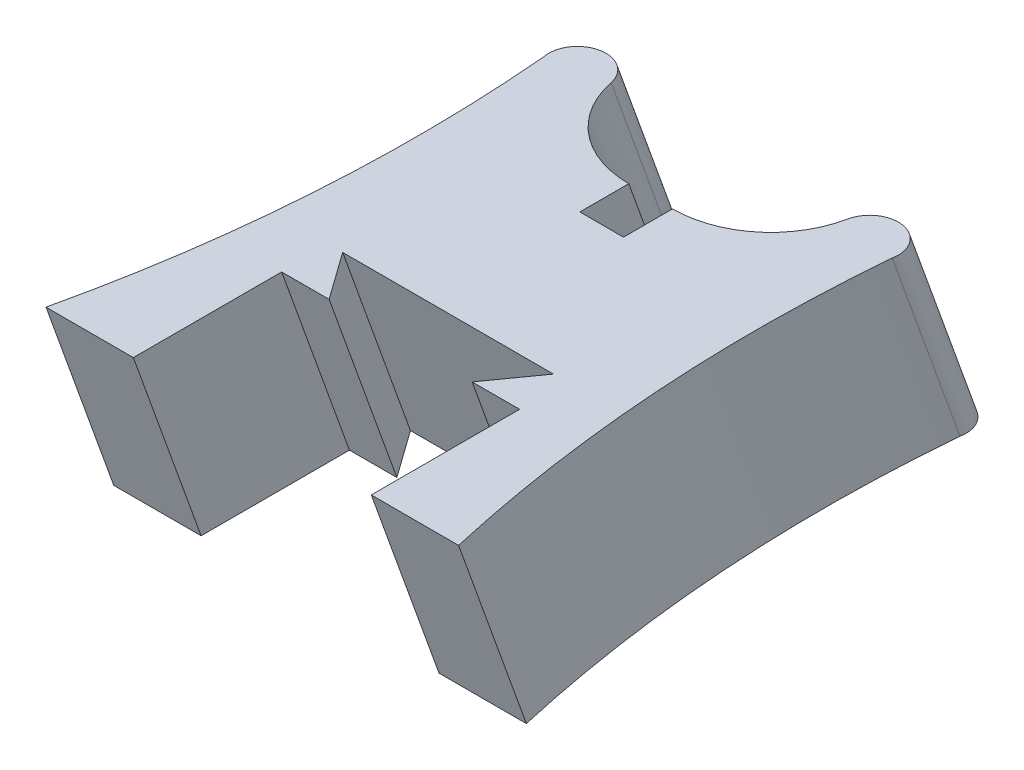
ISO-10303-21;
HEADER;
FILE_DESCRIPTION(('STEP AP214'),'2;1');
FILE_NAME('part.step','',(''),(''),'','','');
FILE_SCHEMA(('AUTOMOTIVE_DESIGN { 1 0 10303 214 1 1 1 1 }'));
ENDSEC;
DATA;
#1=APPLICATION_CONTEXT('core data for automotive mechanical design processes');
#2=APPLICATION_PROTOCOL_DEFINITION('international standard','automotive_design',2000,#1);
#3=PRODUCT_CONTEXT('',#1,'mechanical');
#4=PRODUCT('Part','Part','',(#3));
#5=PRODUCT_RELATED_PRODUCT_CATEGORY('part','',(#4));
#6=PRODUCT_DEFINITION_FORMATION('','',#4);
#7=PRODUCT_DEFINITION_CONTEXT('part definition',#1,'design');
#8=PRODUCT_DEFINITION('design','',#6,#7);
#9=PRODUCT_DEFINITION_SHAPE('','',#8);
#10=(LENGTH_UNIT() NAMED_UNIT(*) SI_UNIT(.MILLI.,.METRE.));
#11=(NAMED_UNIT(*) PLANE_ANGLE_UNIT() SI_UNIT($,.RADIAN.));
#12=(NAMED_UNIT(*) SI_UNIT($,.STERADIAN.) SOLID_ANGLE_UNIT());
#13=UNCERTAINTY_MEASURE_WITH_UNIT(LENGTH_MEASURE(1.E-05),#10,'distance_accuracy_value','');
#14=(GEOMETRIC_REPRESENTATION_CONTEXT(3) GLOBAL_UNCERTAINTY_ASSIGNED_CONTEXT((#13)) GLOBAL_UNIT_ASSIGNED_CONTEXT((#10,
#11,#12)) REPRESENTATION_CONTEXT('',''));
#15=CARTESIAN_POINT('',(0.,0.,0.));
#16=DIRECTION('',(0.,0.,1.));
#17=DIRECTION('',(1.,0.,0.));
#18=AXIS2_PLACEMENT_3D('',#15,#16,#17);
#19=CARTESIAN_POINT('',(56.4865108892808,6.35,1.36219321103716));
#20=DIRECTION('',(0.,-1.,0.));
#21=DIRECTION('',(0.,0.,1.));
#22=AXIS2_PLACEMENT_3D('',#19,#20,#21);
#23=CIRCLE('',#22,50.8);
#24=DIRECTION('',(0.,-0.940887411868727,-0.338719468272742));
#25=VECTOR('',#24,1.);
#26=SURFACE_OF_LINEAR_EXTRUSION('',#23,#25);
#27=CARTESIAN_POINT('',(56.4865108892808,0.,-0.923806788962845));
#28=DIRECTION('',(0.,-1.,0.));
#29=DIRECTION('',(0.,0.,1.));
#30=AXIS2_PLACEMENT_3D('',#27,#28,#29);
#31=CIRCLE('',#30,50.8);
#32=CARTESIAN_POINT('',(6.9596,0.,10.3777461027968));
#33=VERTEX_POINT('',#32);
#34=CARTESIAN_POINT('',(5.87772964845162,0.,-5.32735777855067));
#35=VERTEX_POINT('',#34);
#36=EDGE_CURVE('E189',#33,#35,#31,.T.);
#37=ORIENTED_EDGE('',*,*,#36,.T.);
#38=DIRECTION('',(0.,-0.940887411868727,-0.338719468272742));
#39=VECTOR('',#38,1.);
#40=CARTESIAN_POINT('',(5.87772964845162,6.35,-3.04135777855067));
#41=LINE('',#40,#39);
#42=CARTESIAN_POINT('',(5.87772964845162,6.35,-3.04135777855067));
#43=VERTEX_POINT('',#42);
#44=EDGE_CURVE('E11',#43,#35,#41,.T.);
#45=ORIENTED_EDGE('',*,*,#44,.F.);
#46=CARTESIAN_POINT('',(6.9596,6.35,12.6637461027968));
#47=VERTEX_POINT('',#46);
#48=EDGE_CURVE('E223',#47,#43,#23,.T.);
#49=ORIENTED_EDGE('',*,*,#48,.F.);
#50=DIRECTION('',(0.,-0.940887411868727,-0.338719468272742));
#51=VECTOR('',#50,1.);
#52=CARTESIAN_POINT('',(6.9596,6.35,12.6637461027968));
#53=LINE('',#52,#51);
#54=EDGE_CURVE('E185',#47,#33,#53,.T.);
#55=ORIENTED_EDGE('',*,*,#54,.T.);
#56=EDGE_LOOP('',(#37,#45,#49,#55));
#57=FACE_BOUND('',#56,.T.);
#58=ADVANCED_FACE('F32',(#57),#26,.F.);
#59=CARTESIAN_POINT('',(4.93229971902358,6.35,-3.23420816170402));
#60=DIRECTION('',(0.,1.,0.));
#61=DIRECTION('',(0.,0.,-1.));
#62=AXIS2_PLACEMENT_3D('',#59,#60,#61);
#63=CIRCLE('',#62,0.964898451517419);
#64=DIRECTION('',(0.,-0.940887411868727,-0.338719468272742));
#65=VECTOR('',#64,1.);
#66=SURFACE_OF_LINEAR_EXTRUSION('',#63,#65);
#67=CARTESIAN_POINT('',(4.93229971902358,0.,-5.52020816170402));
#68=DIRECTION('',(0.,1.,0.));
#69=DIRECTION('',(0.,0.,-1.));
#70=AXIS2_PLACEMENT_3D('',#67,#68,#69);
#71=CIRCLE('',#70,0.964898451517419);
#72=CARTESIAN_POINT('',(3.98686978959553,0.,-5.71305854485738));
#73=VERTEX_POINT('',#72);
#74=EDGE_CURVE('E192',#35,#73,#71,.T.);
#75=ORIENTED_EDGE('',*,*,#74,.T.);
#76=DIRECTION('',(0.,-0.940887411868727,-0.338719468272742));
#77=VECTOR('',#76,1.);
#78=CARTESIAN_POINT('',(3.98686978959553,6.35,-3.42705854485738));
#79=LINE('',#78,#77);
#80=CARTESIAN_POINT('',(3.98686978959553,6.35,-3.42705854485738));
#81=VERTEX_POINT('',#80);
#82=EDGE_CURVE('E41',#81,#73,#79,.T.);
#83=ORIENTED_EDGE('',*,*,#82,.F.);
#84=EDGE_CURVE('E122',#43,#81,#63,.T.);
#85=ORIENTED_EDGE('',*,*,#84,.F.);
#86=ORIENTED_EDGE('',*,*,#44,.T.);
#87=EDGE_LOOP('',(#75,#83,#85,#86));
#88=FACE_BOUND('',#87,.T.);
#89=ADVANCED_FACE('F315',(#88),#66,.F.);
#90=CARTESIAN_POINT('',(0.7366,6.35,-4.09005402951957));
#91=DIRECTION('',(0.,-1.,0.));
#92=DIRECTION('',(0.,0.,1.));
#93=AXIS2_PLACEMENT_3D('',#90,#91,#92);
#94=CIRCLE('',#93,3.31720013231639);
#95=DIRECTION('',(0.,-0.940887411868727,-0.338719468272742));
#96=VECTOR('',#95,1.);
#97=SURFACE_OF_LINEAR_EXTRUSION('',#94,#96);
#98=CARTESIAN_POINT('',(0.7366,0.,-6.37605402951957));
#99=DIRECTION('',(0.,-1.,0.));
#100=DIRECTION('',(0.,0.,1.));
#101=AXIS2_PLACEMENT_3D('',#98,#99,#100);
#102=CIRCLE('',#101,3.31720013231639);
#103=CARTESIAN_POINT('',(0.7366,0.,-3.05885389720318));
#104=VERTEX_POINT('',#103);
#105=EDGE_CURVE('E194',#73,#104,#102,.T.);
#106=ORIENTED_EDGE('',*,*,#105,.T.);
#107=DIRECTION('',(0.,-0.940887411868727,-0.338719468272742));
#108=VECTOR('',#107,1.);
#109=CARTESIAN_POINT('',(0.7366,6.35,-0.772853897203182));
#110=LINE('',#109,#108);
#111=CARTESIAN_POINT('',(0.7366,6.35,-0.772853897203182));
#112=VERTEX_POINT('',#111);
#113=EDGE_CURVE('E260',#112,#104,#110,.T.);
#114=ORIENTED_EDGE('',*,*,#113,.F.);
#115=EDGE_CURVE('E268',#81,#112,#94,.T.);
#116=ORIENTED_EDGE('',*,*,#115,.F.);
#117=ORIENTED_EDGE('',*,*,#82,.T.);
#118=EDGE_LOOP('',(#106,#114,#116,#117));
#119=FACE_BOUND('',#118,.T.);
#120=ADVANCED_FACE('F266',(#119),#97,.F.);
#121=CARTESIAN_POINT('',(0.7366,6.35,0.878146102796818));
#122=DIRECTION('',(1.,0.,0.));
#123=DIRECTION('',(0.,0.,-1.));
#124=AXIS2_PLACEMENT_3D('',#121,#122,#123);
#125=PLANE('',#124);
#126=DIRECTION('',(0.,0.,1.));
#127=VECTOR('',#126,1.);
#128=CARTESIAN_POINT('',(0.7366,0.,-1.40785389720318));
#129=LINE('',#128,#127);
#130=CARTESIAN_POINT('',(0.7366,0.,-1.40785389720318));
#131=VERTEX_POINT('',#130);
#132=EDGE_CURVE('E196',#104,#131,#129,.T.);
#133=ORIENTED_EDGE('',*,*,#132,.T.);
#134=DIRECTION('',(0.,-0.940887411868727,-0.338719468272742));
#135=VECTOR('',#134,1.);
#136=CARTESIAN_POINT('',(0.7366,6.35,0.878146102796818));
#137=LINE('',#136,#135);
#138=CARTESIAN_POINT('',(0.7366,6.35,0.878146102796818));
#139=VERTEX_POINT('',#138);
#140=EDGE_CURVE('E257',#139,#131,#137,.T.);
#141=ORIENTED_EDGE('',*,*,#140,.F.);
#142=DIRECTION('',(0.,0.,1.));
#143=VECTOR('',#142,1.);
#144=CARTESIAN_POINT('',(0.7366,6.35,0.878146102796818));
#145=LINE('',#144,#143);
#146=EDGE_CURVE('E286',#112,#139,#145,.T.);
#147=ORIENTED_EDGE('',*,*,#146,.F.);
#148=ORIENTED_EDGE('',*,*,#113,.T.);
#149=EDGE_LOOP('',(#133,#141,#147,#148));
#150=FACE_BOUND('',#149,.T.);
#151=ADVANCED_FACE('F277',(#150),#125,.F.);
#152=CARTESIAN_POINT('',(-0.7366,6.35,0.878146102796818));
#153=DIRECTION('',(0.,-0.338719468272742,0.940887411868727));
#154=DIRECTION('',(0.,-0.940887411868727,-0.338719468272742));
#155=AXIS2_PLACEMENT_3D('',#152,#153,#154);
#156=PLANE('',#155);
#157=DIRECTION('',(-1.,0.,0.));
#158=VECTOR('',#157,1.);
#159=CARTESIAN_POINT('',(-0.7366,0.,-1.40785389720318));
#160=LINE('',#159,#158);
#161=CARTESIAN_POINT('',(-0.7366,0.,-1.40785389720318));
#162=VERTEX_POINT('',#161);
#163=EDGE_CURVE('E198',#131,#162,#160,.T.);
#164=ORIENTED_EDGE('',*,*,#163,.T.);
#165=DIRECTION('',(0.,-0.940887411868727,-0.338719468272742));
#166=VECTOR('',#165,1.);
#167=CARTESIAN_POINT('',(-0.7366,6.35,0.878146102796818));
#168=LINE('',#167,#166);
#169=CARTESIAN_POINT('',(-0.7366,6.35,0.878146102796818));
#170=VERTEX_POINT('',#169);
#171=EDGE_CURVE('E254',#170,#162,#168,.T.);
#172=ORIENTED_EDGE('',*,*,#171,.F.);
#173=DIRECTION('',(-1.,0.,0.));
#174=VECTOR('',#173,1.);
#175=CARTESIAN_POINT('',(-0.7366,6.35,0.878146102796818));
#176=LINE('',#175,#174);
#177=EDGE_CURVE('E283',#139,#170,#176,.T.);
#178=ORIENTED_EDGE('',*,*,#177,.F.);
#179=ORIENTED_EDGE('',*,*,#140,.T.);
#180=EDGE_LOOP('',(#164,#172,#178,#179));
#181=FACE_BOUND('',#180,.T.);
#182=ADVANCED_FACE('F281',(#181),#156,.F.);
#183=CARTESIAN_POINT('',(-0.7366,6.35,-0.772853897203182));
#184=DIRECTION('',(-1.,0.,0.));
#185=DIRECTION('',(0.,0.,1.));
#186=AXIS2_PLACEMENT_3D('',#183,#184,#185);
#187=PLANE('',#186);
#188=DIRECTION('',(0.,0.,-1.));
#189=VECTOR('',#188,1.);
#190=CARTESIAN_POINT('',(-0.7366,0.,-3.05885389720318));
#191=LINE('',#190,#189);
#192=CARTESIAN_POINT('',(-0.7366,0.,-3.05885389720318));
#193=VERTEX_POINT('',#192);
#194=EDGE_CURVE('E200',#162,#193,#191,.T.);
#195=ORIENTED_EDGE('',*,*,#194,.T.);
#196=DIRECTION('',(0.,-0.940887411868727,-0.338719468272742));
#197=VECTOR('',#196,1.);
#198=CARTESIAN_POINT('',(-0.7366,6.35,-0.772853897203181));
#199=LINE('',#198,#197);
#200=CARTESIAN_POINT('',(-0.7366,6.35,-0.772853897203181));
#201=VERTEX_POINT('',#200);
#202=EDGE_CURVE('E251',#201,#193,#199,.T.);
#203=ORIENTED_EDGE('',*,*,#202,.F.);
#204=DIRECTION('',(0.,0.,-1.));
#205=VECTOR('',#204,1.);
#206=CARTESIAN_POINT('',(-0.7366,6.35,-0.772853897203182));
#207=LINE('',#206,#205);
#208=EDGE_CURVE('E285',#170,#201,#207,.T.);
#209=ORIENTED_EDGE('',*,*,#208,.F.);
#210=ORIENTED_EDGE('',*,*,#171,.T.);
#211=EDGE_LOOP('',(#195,#203,#209,#210));
#212=FACE_BOUND('',#211,.T.);
#213=ADVANCED_FACE('F304',(#212),#187,.F.);
#214=CARTESIAN_POINT('',(-0.7366,6.35,-4.09005402951957));
#215=DIRECTION('',(0.,-1.,0.));
#216=DIRECTION('',(0.,0.,-1.));
#217=AXIS2_PLACEMENT_3D('',#214,#215,#216);
#218=CIRCLE('',#217,3.31720013231639);
#219=DIRECTION('',(0.,-0.940887411868727,-0.338719468272742));
#220=VECTOR('',#219,1.);
#221=SURFACE_OF_LINEAR_EXTRUSION('',#218,#220);
#222=CARTESIAN_POINT('',(-0.7366,0.,-6.37605402951957));
#223=DIRECTION('',(0.,-1.,0.));
#224=DIRECTION('',(0.,0.,-1.));
#225=AXIS2_PLACEMENT_3D('',#222,#223,#224);
#226=CIRCLE('',#225,3.31720013231639);
#227=CARTESIAN_POINT('',(-3.98686978959554,0.,-5.71305854485738));
#228=VERTEX_POINT('',#227);
#229=EDGE_CURVE('E202',#193,#228,#226,.T.);
#230=ORIENTED_EDGE('',*,*,#229,.T.);
#231=DIRECTION('',(0.,-0.940887411868727,-0.338719468272742));
#232=VECTOR('',#231,1.);
#233=CARTESIAN_POINT('',(-3.98686978959554,6.35,-3.42705854485738));
#234=LINE('',#233,#232);
#235=CARTESIAN_POINT('',(-3.98686978959554,6.35,-3.42705854485738));
#236=VERTEX_POINT('',#235);
#237=EDGE_CURVE('E248',#236,#228,#234,.T.);
#238=ORIENTED_EDGE('',*,*,#237,.F.);
#239=EDGE_CURVE('E288',#201,#236,#218,.T.);
#240=ORIENTED_EDGE('',*,*,#239,.F.);
#241=ORIENTED_EDGE('',*,*,#202,.T.);
#242=EDGE_LOOP('',(#230,#238,#240,#241));
#243=FACE_BOUND('',#242,.T.);
#244=ADVANCED_FACE('F299',(#243),#221,.F.);
#245=CARTESIAN_POINT('',(-4.93229971902358,6.35,-3.23420816170402));
#246=DIRECTION('',(0.,1.,0.));
#247=DIRECTION('',(0.,0.,1.));
#248=AXIS2_PLACEMENT_3D('',#245,#246,#247);
#249=CIRCLE('',#248,0.964898451517418);
#250=DIRECTION('',(0.,-0.940887411868727,-0.338719468272742));
#251=VECTOR('',#250,1.);
#252=SURFACE_OF_LINEAR_EXTRUSION('',#249,#251);
#253=CARTESIAN_POINT('',(-4.93229971902358,0.,-5.52020816170402));
#254=DIRECTION('',(0.,1.,0.));
#255=DIRECTION('',(0.,0.,1.));
#256=AXIS2_PLACEMENT_3D('',#253,#254,#255);
#257=CIRCLE('',#256,0.964898451517418);
#258=CARTESIAN_POINT('',(-5.87772964845162,0.,-5.32735777855066));
#259=VERTEX_POINT('',#258);
#260=EDGE_CURVE('E204',#228,#259,#257,.T.);
#261=ORIENTED_EDGE('',*,*,#260,.T.);
#262=DIRECTION('',(0.,-0.940887411868727,-0.338719468272742));
#263=VECTOR('',#262,1.);
#264=CARTESIAN_POINT('',(-5.87772964845162,6.35,-3.04135777855066));
#265=LINE('',#264,#263);
#266=CARTESIAN_POINT('',(-5.87772964845162,6.35,-3.04135777855066));
#267=VERTEX_POINT('',#266);
#268=EDGE_CURVE('E245',#267,#259,#265,.T.);
#269=ORIENTED_EDGE('',*,*,#268,.F.);
#270=EDGE_CURVE('E295',#236,#267,#249,.T.);
#271=ORIENTED_EDGE('',*,*,#270,.F.);
#272=ORIENTED_EDGE('',*,*,#237,.T.);
#273=EDGE_LOOP('',(#261,#269,#271,#272));
#274=FACE_BOUND('',#273,.T.);
#275=ADVANCED_FACE('F303',(#274),#252,.F.);
#276=CARTESIAN_POINT('',(-56.4865108892808,6.35,1.36219321103716));
#277=DIRECTION('',(0.,-1.,0.));
#278=DIRECTION('',(0.,0.,-1.));
#279=AXIS2_PLACEMENT_3D('',#276,#277,#278);
#280=CIRCLE('',#279,50.8);
#281=DIRECTION('',(0.,-0.940887411868727,-0.338719468272742));
#282=VECTOR('',#281,1.);
#283=SURFACE_OF_LINEAR_EXTRUSION('',#280,#282);
#284=CARTESIAN_POINT('',(-56.4865108892808,0.,-0.923806788962845));
#285=DIRECTION('',(0.,-1.,0.));
#286=DIRECTION('',(0.,0.,-1.));
#287=AXIS2_PLACEMENT_3D('',#284,#285,#286);
#288=CIRCLE('',#287,50.8);
#289=CARTESIAN_POINT('',(-6.9596,0.,10.3777461027968));
#290=VERTEX_POINT('',#289);
#291=EDGE_CURVE('E206',#259,#290,#288,.T.);
#292=ORIENTED_EDGE('',*,*,#291,.T.);
#293=DIRECTION('',(0.,-0.940887411868727,-0.338719468272742));
#294=VECTOR('',#293,1.);
#295=CARTESIAN_POINT('',(-6.9596,6.35,12.6637461027968));
#296=LINE('',#295,#294);
#297=CARTESIAN_POINT('',(-6.9596,6.35,12.6637461027968));
#298=VERTEX_POINT('',#297);
#299=EDGE_CURVE('E242',#298,#290,#296,.T.);
#300=ORIENTED_EDGE('',*,*,#299,.F.);
#301=EDGE_CURVE('E485',#267,#298,#280,.T.);
#302=ORIENTED_EDGE('',*,*,#301,.F.);
#303=ORIENTED_EDGE('',*,*,#268,.T.);
#304=EDGE_LOOP('',(#292,#300,#302,#303));
#305=FACE_BOUND('',#304,.T.);
#306=ADVANCED_FACE('F372',(#305),#283,.F.);
#307=CARTESIAN_POINT('',(-4.0132,6.35,12.6637461027968));
#308=DIRECTION('',(0.,0.338719468272742,-0.940887411868727));
#309=DIRECTION('',(0.,0.940887411868727,0.338719468272742));
#310=AXIS2_PLACEMENT_3D('',#307,#308,#309);
#311=PLANE('',#310);
#312=DIRECTION('',(1.,0.,0.));
#313=VECTOR('',#312,1.);
#314=CARTESIAN_POINT('',(-4.0132,0.,10.3777461027968));
#315=LINE('',#314,#313);
#316=CARTESIAN_POINT('',(-4.0132,0.,10.3777461027968));
#317=VERTEX_POINT('',#316);
#318=EDGE_CURVE('E208',#290,#317,#315,.T.);
#319=ORIENTED_EDGE('',*,*,#318,.T.);
#320=DIRECTION('',(0.,-0.940887411868727,-0.338719468272742));
#321=VECTOR('',#320,1.);
#322=CARTESIAN_POINT('',(-4.0132,6.35,12.6637461027968));
#323=LINE('',#322,#321);
#324=CARTESIAN_POINT('',(-4.0132,6.35,12.6637461027968));
#325=VERTEX_POINT('',#324);
#326=EDGE_CURVE('E239',#325,#317,#323,.T.);
#327=ORIENTED_EDGE('',*,*,#326,.F.);
#328=DIRECTION('',(1.,0.,0.));
#329=VECTOR('',#328,1.);
#330=CARTESIAN_POINT('',(-4.0132,6.35,12.6637461027968));
#331=LINE('',#330,#329);
#332=EDGE_CURVE('E488',#298,#325,#331,.T.);
#333=ORIENTED_EDGE('',*,*,#332,.F.);
#334=ORIENTED_EDGE('',*,*,#299,.T.);
#335=EDGE_LOOP('',(#319,#327,#333,#334));
#336=FACE_BOUND('',#335,.T.);
#337=ADVANCED_FACE('F381',(#336),#311,.F.);
#338=CARTESIAN_POINT('',(-4.0132,6.35,7.65994610279682));
#339=DIRECTION('',(-1.,0.,0.));
#340=DIRECTION('',(0.,0.,1.));
#341=AXIS2_PLACEMENT_3D('',#338,#339,#340);
#342=PLANE('',#341);
#343=DIRECTION('',(0.,0.,-1.));
#344=VECTOR('',#343,1.);
#345=CARTESIAN_POINT('',(-4.0132,0.,5.37394610279682));
#346=LINE('',#345,#344);
#347=CARTESIAN_POINT('',(-4.0132,0.,5.37394610279682));
#348=VERTEX_POINT('',#347);
#349=EDGE_CURVE('E210',#317,#348,#346,.T.);
#350=ORIENTED_EDGE('',*,*,#349,.T.);
#351=DIRECTION('',(0.,-0.940887411868727,-0.338719468272742));
#352=VECTOR('',#351,1.);
#353=CARTESIAN_POINT('',(-4.0132,6.35,7.65994610279682));
#354=LINE('',#353,#352);
#355=CARTESIAN_POINT('',(-4.0132,6.35,7.65994610279682));
#356=VERTEX_POINT('',#355);
#357=EDGE_CURVE('E236',#356,#348,#354,.T.);
#358=ORIENTED_EDGE('',*,*,#357,.F.);
#359=DIRECTION('',(0.,0.,-1.));
#360=VECTOR('',#359,1.);
#361=CARTESIAN_POINT('',(-4.0132,6.35,7.65994610279682));
#362=LINE('',#361,#360);
#363=EDGE_CURVE('E490',#325,#356,#362,.T.);
#364=ORIENTED_EDGE('',*,*,#363,.F.);
#365=ORIENTED_EDGE('',*,*,#326,.T.);
#366=EDGE_LOOP('',(#350,#358,#364,#365));
#367=FACE_BOUND('',#366,.T.);
#368=ADVANCED_FACE('F390',(#367),#342,.F.);
#369=CARTESIAN_POINT('',(-2.413,6.35,7.65994610279682));
#370=DIRECTION('',(0.,0.338719468272742,-0.940887411868727));
#371=DIRECTION('',(0.,0.940887411868727,0.338719468272742));
#372=AXIS2_PLACEMENT_3D('',#369,#370,#371);
#373=PLANE('',#372);
#374=DIRECTION('',(1.,0.,0.));
#375=VECTOR('',#374,1.);
#376=CARTESIAN_POINT('',(-2.413,0.,5.37394610279682));
#377=LINE('',#376,#375);
#378=CARTESIAN_POINT('',(-2.413,0.,5.37394610279682));
#379=VERTEX_POINT('',#378);
#380=EDGE_CURVE('E212',#348,#379,#377,.T.);
#381=ORIENTED_EDGE('',*,*,#380,.T.);
#382=DIRECTION('',(0.,-0.940887411868727,-0.338719468272742));
#383=VECTOR('',#382,1.);
#384=CARTESIAN_POINT('',(-2.413,6.35,7.65994610279682));
#385=LINE('',#384,#383);
#386=CARTESIAN_POINT('',(-2.413,6.35,7.65994610279682));
#387=VERTEX_POINT('',#386);
#388=EDGE_CURVE('E233',#387,#379,#385,.T.);
#389=ORIENTED_EDGE('',*,*,#388,.F.);
#390=DIRECTION('',(1.,0.,0.));
#391=VECTOR('',#390,1.);
#392=CARTESIAN_POINT('',(-2.413,6.35,7.65994610279682));
#393=LINE('',#392,#391);
#394=EDGE_CURVE('E492',#356,#387,#393,.T.);
#395=ORIENTED_EDGE('',*,*,#394,.F.);
#396=ORIENTED_EDGE('',*,*,#357,.T.);
#397=EDGE_LOOP('',(#381,#389,#395,#396));
#398=FACE_BOUND('',#397,.T.);
#399=ADVANCED_FACE('F400',(#398),#373,.F.);
#400=CARTESIAN_POINT('',(-3.556,6.35,6.05974610279682));
#401=DIRECTION('',(-0.796483727597301,-0.204810101382163,0.568916948283787));
#402=DIRECTION('',(0.581238193719097,0.,0.813733471206735));
#403=AXIS2_PLACEMENT_3D('',#400,#401,#402);
#404=PLANE('',#403);
#405=DIRECTION('',(-0.581238193719097,0.,-0.813733471206735));
#406=VECTOR('',#405,1.);
#407=CARTESIAN_POINT('',(-3.556,0.,3.77374610279682));
#408=LINE('',#407,#406);
#409=CARTESIAN_POINT('',(-3.556,0.,3.77374610279682));
#410=VERTEX_POINT('',#409);
#411=EDGE_CURVE('E214',#379,#410,#408,.T.);
#412=ORIENTED_EDGE('',*,*,#411,.T.);
#413=DIRECTION('',(0.,-0.940887411868727,-0.338719468272742));
#414=VECTOR('',#413,1.);
#415=CARTESIAN_POINT('',(-3.556,6.35,6.05974610279682));
#416=LINE('',#415,#414);
#417=CARTESIAN_POINT('',(-3.556,6.35,6.05974610279682));
#418=VERTEX_POINT('',#417);
#419=EDGE_CURVE('E230',#418,#410,#416,.T.);
#420=ORIENTED_EDGE('',*,*,#419,.F.);
#421=DIRECTION('',(-0.581238193719097,0.,-0.813733471206735));
#422=VECTOR('',#421,1.);
#423=CARTESIAN_POINT('',(-3.556,6.35,6.05974610279682));
#424=LINE('',#423,#422);
#425=EDGE_CURVE('E494',#387,#418,#424,.T.);
#426=ORIENTED_EDGE('',*,*,#425,.F.);
#427=ORIENTED_EDGE('',*,*,#388,.T.);
#428=EDGE_LOOP('',(#412,#420,#426,#427));
#429=FACE_BOUND('',#428,.T.);
#430=ADVANCED_FACE('F410',(#429),#404,.F.);
#431=CARTESIAN_POINT('',(3.556,6.35,6.05974610279682));
#432=DIRECTION('',(0.,0.338719468272742,-0.940887411868727));
#433=DIRECTION('',(0.,0.940887411868727,0.338719468272742));
#434=AXIS2_PLACEMENT_3D('',#431,#432,#433);
#435=PLANE('',#434);
#436=DIRECTION('',(1.,0.,0.));
#437=VECTOR('',#436,1.);
#438=CARTESIAN_POINT('',(3.556,0.,3.77374610279682));
#439=LINE('',#438,#437);
#440=CARTESIAN_POINT('',(3.556,0.,3.77374610279682));
#441=VERTEX_POINT('',#440);
#442=EDGE_CURVE('E216',#410,#441,#439,.T.);
#443=ORIENTED_EDGE('',*,*,#442,.T.);
#444=DIRECTION('',(0.,-0.940887411868727,-0.338719468272742));
#445=VECTOR('',#444,1.);
#446=CARTESIAN_POINT('',(3.556,6.35,6.05974610279682));
#447=LINE('',#446,#445);
#448=CARTESIAN_POINT('',(3.556,6.35,6.05974610279682));
#449=VERTEX_POINT('',#448);
#450=EDGE_CURVE('E227',#449,#441,#447,.T.);
#451=ORIENTED_EDGE('',*,*,#450,.F.);
#452=DIRECTION('',(1.,0.,0.));
#453=VECTOR('',#452,1.);
#454=CARTESIAN_POINT('',(3.556,6.35,6.05974610279682));
#455=LINE('',#454,#453);
#456=EDGE_CURVE('E496',#418,#449,#455,.T.);
#457=ORIENTED_EDGE('',*,*,#456,.F.);
#458=ORIENTED_EDGE('',*,*,#419,.T.);
#459=EDGE_LOOP('',(#443,#451,#457,#458));
#460=FACE_BOUND('',#459,.T.);
#461=ADVANCED_FACE('F420',(#460),#435,.F.);
#462=CARTESIAN_POINT('',(2.413,6.35,7.65994610279682));
#463=DIRECTION('',(0.796483727597301,-0.204810101382163,0.568916948283787));
#464=DIRECTION('',(0.581238193719097,0.,-0.813733471206735));
#465=AXIS2_PLACEMENT_3D('',#462,#463,#464);
#466=PLANE('',#465);
#467=DIRECTION('',(-0.581238193719097,0.,0.813733471206735));
#468=VECTOR('',#467,1.);
#469=CARTESIAN_POINT('',(2.413,0.,5.37394610279682));
#470=LINE('',#469,#468);
#471=CARTESIAN_POINT('',(2.413,0.,5.37394610279682));
#472=VERTEX_POINT('',#471);
#473=EDGE_CURVE('E218',#441,#472,#470,.T.);
#474=ORIENTED_EDGE('',*,*,#473,.T.);
#475=DIRECTION('',(0.,-0.940887411868727,-0.338719468272742));
#476=VECTOR('',#475,1.);
#477=CARTESIAN_POINT('',(2.413,6.35,7.65994610279682));
#478=LINE('',#477,#476);
#479=CARTESIAN_POINT('',(2.413,6.35,7.65994610279682));
#480=VERTEX_POINT('',#479);
#481=EDGE_CURVE('E180',#480,#472,#478,.T.);
#482=ORIENTED_EDGE('',*,*,#481,.F.);
#483=DIRECTION('',(-0.581238193719097,0.,0.813733471206735));
#484=VECTOR('',#483,1.);
#485=CARTESIAN_POINT('',(2.413,6.35,7.65994610279682));
#486=LINE('',#485,#484);
#487=EDGE_CURVE('E171',#449,#480,#486,.T.);
#488=ORIENTED_EDGE('',*,*,#487,.F.);
#489=ORIENTED_EDGE('',*,*,#450,.T.);
#490=EDGE_LOOP('',(#474,#482,#488,#489));
#491=FACE_BOUND('',#490,.T.);
#492=ADVANCED_FACE('F430',(#491),#466,.F.);
#493=CARTESIAN_POINT('',(4.0132,6.35,7.65994610279682));
#494=DIRECTION('',(0.,0.338719468272742,-0.940887411868727));
#495=DIRECTION('',(0.,0.940887411868727,0.338719468272742));
#496=AXIS2_PLACEMENT_3D('',#493,#494,#495);
#497=PLANE('',#496);
#498=DIRECTION('',(1.,0.,0.));
#499=VECTOR('',#498,1.);
#500=CARTESIAN_POINT('',(4.0132,0.,5.37394610279682));
#501=LINE('',#500,#499);
#502=CARTESIAN_POINT('',(4.0132,0.,5.37394610279682));
#503=VERTEX_POINT('',#502);
#504=EDGE_CURVE('E179',#472,#503,#501,.T.);
#505=ORIENTED_EDGE('',*,*,#504,.T.);
#506=DIRECTION('',(0.,-0.940887411868727,-0.338719468272742));
#507=VECTOR('',#506,1.);
#508=CARTESIAN_POINT('',(4.0132,6.35,7.65994610279682));
#509=LINE('',#508,#507);
#510=CARTESIAN_POINT('',(4.0132,6.35,7.65994610279682));
#511=VERTEX_POINT('',#510);
#512=EDGE_CURVE('E176',#511,#503,#509,.T.);
#513=ORIENTED_EDGE('',*,*,#512,.F.);
#514=DIRECTION('',(1.,0.,0.));
#515=VECTOR('',#514,1.);
#516=CARTESIAN_POINT('',(4.0132,6.35,7.65994610279682));
#517=LINE('',#516,#515);
#518=EDGE_CURVE('E165',#480,#511,#517,.T.);
#519=ORIENTED_EDGE('',*,*,#518,.F.);
#520=ORIENTED_EDGE('',*,*,#481,.T.);
#521=EDGE_LOOP('',(#505,#513,#519,#520));
#522=FACE_BOUND('',#521,.T.);
#523=ADVANCED_FACE('F177',(#522),#497,.F.);
#524=CARTESIAN_POINT('',(4.0132,6.35,12.6637461027968));
#525=DIRECTION('',(1.,0.,0.));
#526=DIRECTION('',(0.,0.,-1.));
#527=AXIS2_PLACEMENT_3D('',#524,#525,#526);
#528=PLANE('',#527);
#529=DIRECTION('',(0.,0.,1.));
#530=VECTOR('',#529,1.);
#531=CARTESIAN_POINT('',(4.0132,0.,10.3777461027968));
#532=LINE('',#531,#530);
#533=CARTESIAN_POINT('',(4.0132,0.,10.3777461027968));
#534=VERTEX_POINT('',#533);
#535=EDGE_CURVE('E108',#503,#534,#532,.T.);
#536=ORIENTED_EDGE('',*,*,#535,.T.);
#537=DIRECTION('',(0.,-0.940887411868727,-0.338719468272742));
#538=VECTOR('',#537,1.);
#539=CARTESIAN_POINT('',(4.0132,6.35,12.6637461027968));
#540=LINE('',#539,#538);
#541=CARTESIAN_POINT('',(4.0132,6.35,12.6637461027968));
#542=VERTEX_POINT('',#541);
#543=EDGE_CURVE('E181',#542,#534,#540,.T.);
#544=ORIENTED_EDGE('',*,*,#543,.F.);
#545=DIRECTION('',(0.,0.,1.));
#546=VECTOR('',#545,1.);
#547=CARTESIAN_POINT('',(4.0132,6.35,12.6637461027968));
#548=LINE('',#547,#546);
#549=EDGE_CURVE('E169',#511,#542,#548,.T.);
#550=ORIENTED_EDGE('',*,*,#549,.F.);
#551=ORIENTED_EDGE('',*,*,#512,.T.);
#552=EDGE_LOOP('',(#536,#544,#550,#551));
#553=FACE_BOUND('',#552,.T.);
#554=ADVANCED_FACE('F183',(#553),#528,.F.);
#555=CARTESIAN_POINT('',(6.9596,6.35,12.6637461027968));
#556=DIRECTION('',(0.,0.338719468272742,-0.940887411868727));
#557=DIRECTION('',(0.,0.940887411868727,0.338719468272742));
#558=AXIS2_PLACEMENT_3D('',#555,#556,#557);
#559=PLANE('',#558);
#560=DIRECTION('',(1.,0.,0.));
#561=VECTOR('',#560,1.);
#562=CARTESIAN_POINT('',(6.9596,0.,10.3777461027968));
#563=LINE('',#562,#561);
#564=EDGE_CURVE('E114',#534,#33,#563,.T.);
#565=ORIENTED_EDGE('',*,*,#564,.T.);
#566=ORIENTED_EDGE('',*,*,#54,.F.);
#567=DIRECTION('',(1.,0.,0.));
#568=VECTOR('',#567,1.);
#569=CARTESIAN_POINT('',(6.9596,6.35,12.6637461027968));
#570=LINE('',#569,#568);
#571=EDGE_CURVE('E49',#542,#47,#570,.T.);
#572=ORIENTED_EDGE('',*,*,#571,.F.);
#573=ORIENTED_EDGE('',*,*,#543,.T.);
#574=EDGE_LOOP('',(#565,#566,#572,#573));
#575=FACE_BOUND('',#574,.T.);
#576=ADVANCED_FACE('F457',(#575),#559,.F.);
#577=CARTESIAN_POINT('',(56.4865108892808,6.35,1.36219321103716));
#578=DIRECTION('',(0.,1.,0.));
#579=DIRECTION('',(0.,0.,1.));
#580=AXIS2_PLACEMENT_3D('',#577,#578,#579);
#581=PLANE('',#580);
#582=ORIENTED_EDGE('',*,*,#48,.T.);
#583=ORIENTED_EDGE('',*,*,#84,.T.);
#584=ORIENTED_EDGE('',*,*,#115,.T.);
#585=ORIENTED_EDGE('',*,*,#146,.T.);
#586=ORIENTED_EDGE('',*,*,#177,.T.);
#587=ORIENTED_EDGE('',*,*,#208,.T.);
#588=ORIENTED_EDGE('',*,*,#239,.T.);
#589=ORIENTED_EDGE('',*,*,#270,.T.);
#590=ORIENTED_EDGE('',*,*,#301,.T.);
#591=ORIENTED_EDGE('',*,*,#332,.T.);
#592=ORIENTED_EDGE('',*,*,#363,.T.);
#593=ORIENTED_EDGE('',*,*,#394,.T.);
#594=ORIENTED_EDGE('',*,*,#425,.T.);
#595=ORIENTED_EDGE('',*,*,#456,.T.);
#596=ORIENTED_EDGE('',*,*,#487,.T.);
#597=ORIENTED_EDGE('',*,*,#518,.T.);
#598=ORIENTED_EDGE('',*,*,#549,.T.);
#599=ORIENTED_EDGE('',*,*,#571,.T.);
#600=EDGE_LOOP('',(#582,#583,#584,#585,#586,#587,#588,#589,#590,#591,#592,#593,#594,#595,#596,
#597,#598,#599));
#601=FACE_BOUND('',#600,.T.);
#602=ADVANCED_FACE('F167',(#601),#581,.T.);
#603=CARTESIAN_POINT('',(56.4865108892808,0.,-0.923806788962845));
#604=DIRECTION('',(0.,1.,0.));
#605=DIRECTION('',(0.,0.,1.));
#606=AXIS2_PLACEMENT_3D('',#603,#604,#605);
#607=PLANE('',#606);
#608=ORIENTED_EDGE('',*,*,#36,.F.);
#609=ORIENTED_EDGE('',*,*,#564,.F.);
#610=ORIENTED_EDGE('',*,*,#535,.F.);
#611=ORIENTED_EDGE('',*,*,#504,.F.);
#612=ORIENTED_EDGE('',*,*,#473,.F.);
#613=ORIENTED_EDGE('',*,*,#442,.F.);
#614=ORIENTED_EDGE('',*,*,#411,.F.);
#615=ORIENTED_EDGE('',*,*,#380,.F.);
#616=ORIENTED_EDGE('',*,*,#349,.F.);
#617=ORIENTED_EDGE('',*,*,#318,.F.);
#618=ORIENTED_EDGE('',*,*,#291,.F.);
#619=ORIENTED_EDGE('',*,*,#260,.F.);
#620=ORIENTED_EDGE('',*,*,#229,.F.);
#621=ORIENTED_EDGE('',*,*,#194,.F.);
#622=ORIENTED_EDGE('',*,*,#163,.F.);
#623=ORIENTED_EDGE('',*,*,#132,.F.);
#624=ORIENTED_EDGE('',*,*,#105,.F.);
#625=ORIENTED_EDGE('',*,*,#74,.F.);
#626=EDGE_LOOP('',(#608,#609,#610,#611,#612,#613,#614,#615,#616,#617,#618,#619,#620,#621,#622,
#623,#624,#625));
#627=FACE_BOUND('',#626,.T.);
#628=ADVANCED_FACE('F272',(#627),#607,.F.);
#629=CLOSED_SHELL('',(#58,#89,#120,#151,#182,#213,#244,#275,#306,#337,#368,#399,#430,#461,#492,
#523,#554,#576,#602,#628));
#630=MANIFOLD_SOLID_BREP('B2',#629);
#631=ADVANCED_BREP_SHAPE_REPRESENTATION('',(#18,#630),#14);
#632=SHAPE_DEFINITION_REPRESENTATION(#9,#631);
ENDSEC;
END-ISO-10303-21;
